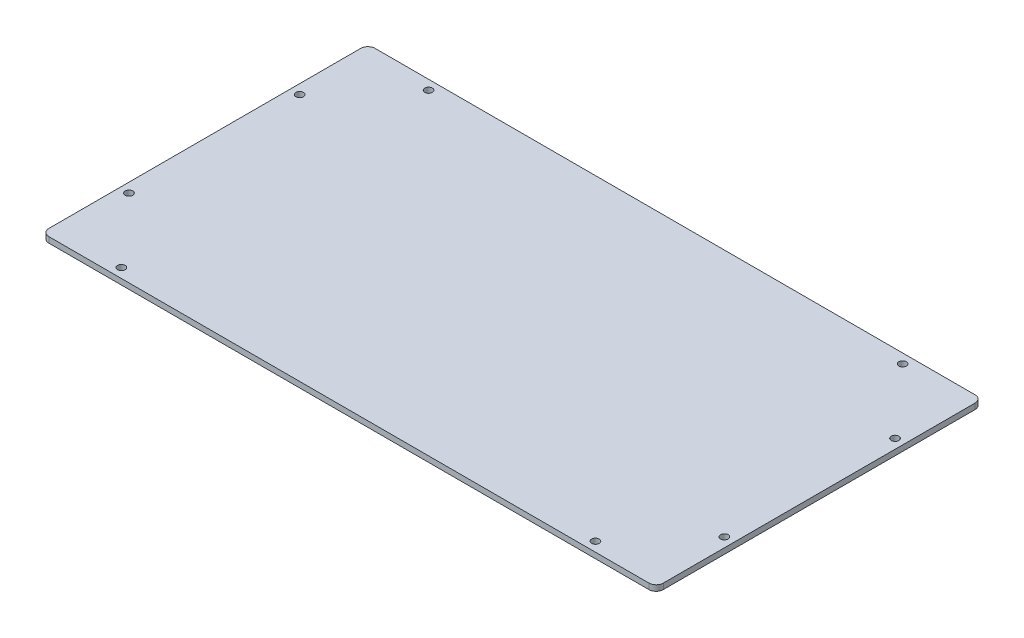
ISO-10303-21;
HEADER;
FILE_DESCRIPTION(('STEP AP214'),'2;1');
FILE_NAME('part.step','',(''),(''),'','','');
FILE_SCHEMA(('AUTOMOTIVE_DESIGN { 1 0 10303 214 1 1 1 1 }'));
ENDSEC;
DATA;
#1=APPLICATION_CONTEXT('core data for automotive mechanical design processes');
#2=APPLICATION_PROTOCOL_DEFINITION('international standard','automotive_design',2000,#1);
#3=PRODUCT_CONTEXT('',#1,'mechanical');
#4=PRODUCT('Part','Part','',(#3));
#5=PRODUCT_RELATED_PRODUCT_CATEGORY('part','',(#4));
#6=PRODUCT_DEFINITION_FORMATION('','',#4);
#7=PRODUCT_DEFINITION_CONTEXT('part definition',#1,'design');
#8=PRODUCT_DEFINITION('design','',#6,#7);
#9=PRODUCT_DEFINITION_SHAPE('','',#8);
#10=(LENGTH_UNIT() NAMED_UNIT(*) SI_UNIT(.MILLI.,.METRE.));
#11=(NAMED_UNIT(*) PLANE_ANGLE_UNIT() SI_UNIT($,.RADIAN.));
#12=(NAMED_UNIT(*) SI_UNIT($,.STERADIAN.) SOLID_ANGLE_UNIT());
#13=UNCERTAINTY_MEASURE_WITH_UNIT(LENGTH_MEASURE(1.E-05),#10,'distance_accuracy_value','');
#14=(GEOMETRIC_REPRESENTATION_CONTEXT(3) GLOBAL_UNCERTAINTY_ASSIGNED_CONTEXT((#13)) GLOBAL_UNIT_ASSIGNED_CONTEXT((#10,
#11,#12)) REPRESENTATION_CONTEXT('',''));
#15=CARTESIAN_POINT('',(0.,0.,0.));
#16=DIRECTION('',(0.,0.,1.));
#17=DIRECTION('',(1.,0.,0.));
#18=AXIS2_PLACEMENT_3D('',#15,#16,#17);
#19=CARTESIAN_POINT('',(158.2,0.,-82.2));
#20=DIRECTION('',(0.,-1.,0.));
#21=DIRECTION('',(0.,0.,-1.));
#22=AXIS2_PLACEMENT_3D('',#19,#20,#21);
#23=CYLINDRICAL_SURFACE('',#22,3.8);
#24=CARTESIAN_POINT('',(158.2,-3.,-82.2));
#25=DIRECTION('',(0.,-1.,0.));
#26=DIRECTION('',(0.,0.,-1.));
#27=AXIS2_PLACEMENT_3D('',#24,#25,#26);
#28=CIRCLE('',#27,3.8);
#29=CARTESIAN_POINT('',(158.2,-3.,-86.));
#30=VERTEX_POINT('',#29);
#31=CARTESIAN_POINT('',(162.,-3.,-82.2));
#32=VERTEX_POINT('',#31);
#33=EDGE_CURVE('E131',#30,#32,#28,.T.);
#34=ORIENTED_EDGE('',*,*,#33,.F.);
#35=DIRECTION('',(0.,-1.,0.));
#36=VECTOR('',#35,1.);
#37=CARTESIAN_POINT('',(158.2,0.,-86.));
#38=LINE('',#37,#36);
#39=CARTESIAN_POINT('',(158.2,0.,-86.));
#40=VERTEX_POINT('',#39);
#41=EDGE_CURVE('E11',#40,#30,#38,.T.);
#42=ORIENTED_EDGE('',*,*,#41,.F.);
#43=CARTESIAN_POINT('',(158.2,0.,-82.2));
#44=DIRECTION('',(0.,-1.,0.));
#45=DIRECTION('',(0.,0.,-1.));
#46=AXIS2_PLACEMENT_3D('',#43,#44,#45);
#47=CIRCLE('',#46,3.8);
#48=CARTESIAN_POINT('',(162.,0.,-82.2));
#49=VERTEX_POINT('',#48);
#50=EDGE_CURVE('E152',#40,#49,#47,.T.);
#51=ORIENTED_EDGE('',*,*,#50,.T.);
#52=DIRECTION('',(0.,-1.,0.));
#53=VECTOR('',#52,1.);
#54=CARTESIAN_POINT('',(162.,0.,-82.2));
#55=LINE('',#54,#53);
#56=EDGE_CURVE('E37',#49,#32,#55,.T.);
#57=ORIENTED_EDGE('',*,*,#56,.T.);
#58=EDGE_LOOP('',(#34,#42,#51,#57));
#59=FACE_BOUND('',#58,.T.);
#60=ADVANCED_FACE('F34',(#59),#23,.T.);
#61=CARTESIAN_POINT('',(-158.2,0.,-86.));
#62=DIRECTION('',(0.,0.,-1.));
#63=DIRECTION('',(-1.,0.,0.));
#64=AXIS2_PLACEMENT_3D('',#61,#62,#63);
#65=PLANE('',#64);
#66=DIRECTION('',(1.,0.,0.));
#67=VECTOR('',#66,1.);
#68=CARTESIAN_POINT('',(-158.2,-3.,-86.));
#69=LINE('',#68,#67);
#70=CARTESIAN_POINT('',(-158.2,-3.,-86.));
#71=VERTEX_POINT('',#70);
#72=EDGE_CURVE('E150',#71,#30,#69,.T.);
#73=ORIENTED_EDGE('',*,*,#72,.F.);
#74=DIRECTION('',(0.,-1.,0.));
#75=VECTOR('',#74,1.);
#76=CARTESIAN_POINT('',(-158.2,0.,-86.));
#77=LINE('',#76,#75);
#78=CARTESIAN_POINT('',(-158.2,0.,-86.));
#79=VERTEX_POINT('',#78);
#80=EDGE_CURVE('E43',#79,#71,#77,.T.);
#81=ORIENTED_EDGE('',*,*,#80,.F.);
#82=DIRECTION('',(1.,0.,0.));
#83=VECTOR('',#82,1.);
#84=CARTESIAN_POINT('',(-158.2,0.,-86.));
#85=LINE('',#84,#83);
#86=EDGE_CURVE('E121',#79,#40,#85,.T.);
#87=ORIENTED_EDGE('',*,*,#86,.T.);
#88=ORIENTED_EDGE('',*,*,#41,.T.);
#89=EDGE_LOOP('',(#73,#81,#87,#88));
#90=FACE_BOUND('',#89,.T.);
#91=ADVANCED_FACE('F164',(#90),#65,.T.);
#92=CARTESIAN_POINT('',(-158.2,0.,-82.2));
#93=DIRECTION('',(0.,-1.,0.));
#94=DIRECTION('',(0.,0.,-1.));
#95=AXIS2_PLACEMENT_3D('',#92,#93,#94);
#96=CYLINDRICAL_SURFACE('',#95,3.8);
#97=CARTESIAN_POINT('',(-158.2,-3.,-82.2));
#98=DIRECTION('',(0.,-1.,0.));
#99=DIRECTION('',(0.,0.,-1.));
#100=AXIS2_PLACEMENT_3D('',#97,#98,#99);
#101=CIRCLE('',#100,3.8);
#102=CARTESIAN_POINT('',(-162.,-3.,-82.2));
#103=VERTEX_POINT('',#102);
#104=EDGE_CURVE('E108',#103,#71,#101,.T.);
#105=ORIENTED_EDGE('',*,*,#104,.F.);
#106=DIRECTION('',(0.,-1.,0.));
#107=VECTOR('',#106,1.);
#108=CARTESIAN_POINT('',(-162.,0.,-82.2));
#109=LINE('',#108,#107);
#110=CARTESIAN_POINT('',(-162.,0.,-82.2));
#111=VERTEX_POINT('',#110);
#112=EDGE_CURVE('E103',#111,#103,#109,.T.);
#113=ORIENTED_EDGE('',*,*,#112,.F.);
#114=CARTESIAN_POINT('',(-158.2,0.,-82.2));
#115=DIRECTION('',(0.,-1.,0.));
#116=DIRECTION('',(0.,0.,-1.));
#117=AXIS2_PLACEMENT_3D('',#114,#115,#116);
#118=CIRCLE('',#117,3.8);
#119=EDGE_CURVE('E106',#111,#79,#118,.T.);
#120=ORIENTED_EDGE('',*,*,#119,.T.);
#121=ORIENTED_EDGE('',*,*,#80,.T.);
#122=EDGE_LOOP('',(#105,#113,#120,#121));
#123=FACE_BOUND('',#122,.T.);
#124=ADVANCED_FACE('F105',(#123),#96,.T.);
#125=CARTESIAN_POINT('',(-162.,0.,82.2));
#126=DIRECTION('',(-1.,0.,0.));
#127=DIRECTION('',(0.,0.,1.));
#128=AXIS2_PLACEMENT_3D('',#125,#126,#127);
#129=PLANE('',#128);
#130=DIRECTION('',(0.,0.,-1.));
#131=VECTOR('',#130,1.);
#132=CARTESIAN_POINT('',(-162.,-3.,82.2));
#133=LINE('',#132,#131);
#134=CARTESIAN_POINT('',(-162.,-3.,82.2));
#135=VERTEX_POINT('',#134);
#136=EDGE_CURVE('E147',#135,#103,#133,.T.);
#137=ORIENTED_EDGE('',*,*,#136,.F.);
#138=DIRECTION('',(0.,-1.,0.));
#139=VECTOR('',#138,1.);
#140=CARTESIAN_POINT('',(-162.,0.,82.2));
#141=LINE('',#140,#139);
#142=CARTESIAN_POINT('',(-162.,0.,82.2));
#143=VERTEX_POINT('',#142);
#144=EDGE_CURVE('E113',#143,#135,#141,.T.);
#145=ORIENTED_EDGE('',*,*,#144,.F.);
#146=DIRECTION('',(0.,0.,-1.));
#147=VECTOR('',#146,1.);
#148=CARTESIAN_POINT('',(-162.,0.,82.2));
#149=LINE('',#148,#147);
#150=EDGE_CURVE('E119',#143,#111,#149,.T.);
#151=ORIENTED_EDGE('',*,*,#150,.T.);
#152=ORIENTED_EDGE('',*,*,#112,.T.);
#153=EDGE_LOOP('',(#137,#145,#151,#152));
#154=FACE_BOUND('',#153,.T.);
#155=ADVANCED_FACE('F123',(#154),#129,.T.);
#156=CARTESIAN_POINT('',(-158.2,0.,82.2));
#157=DIRECTION('',(0.,-1.,0.));
#158=DIRECTION('',(0.,0.,-1.));
#159=AXIS2_PLACEMENT_3D('',#156,#157,#158);
#160=CYLINDRICAL_SURFACE('',#159,3.8);
#161=CARTESIAN_POINT('',(-158.2,-3.,82.2));
#162=DIRECTION('',(0.,-1.,0.));
#163=DIRECTION('',(0.,0.,-1.));
#164=AXIS2_PLACEMENT_3D('',#161,#162,#163);
#165=CIRCLE('',#164,3.8);
#166=CARTESIAN_POINT('',(-158.2,-3.,86.));
#167=VERTEX_POINT('',#166);
#168=EDGE_CURVE('E144',#167,#135,#165,.T.);
#169=ORIENTED_EDGE('',*,*,#168,.F.);
#170=DIRECTION('',(0.,-1.,0.));
#171=VECTOR('',#170,1.);
#172=CARTESIAN_POINT('',(-158.2,0.,86.));
#173=LINE('',#172,#171);
#174=CARTESIAN_POINT('',(-158.2,0.,86.));
#175=VERTEX_POINT('',#174);
#176=EDGE_CURVE('E156',#175,#167,#173,.T.);
#177=ORIENTED_EDGE('',*,*,#176,.F.);
#178=CARTESIAN_POINT('',(-158.2,0.,82.2));
#179=DIRECTION('',(0.,-1.,0.));
#180=DIRECTION('',(0.,0.,-1.));
#181=AXIS2_PLACEMENT_3D('',#178,#179,#180);
#182=CIRCLE('',#181,3.8);
#183=EDGE_CURVE('E124',#175,#143,#182,.T.);
#184=ORIENTED_EDGE('',*,*,#183,.T.);
#185=ORIENTED_EDGE('',*,*,#144,.T.);
#186=EDGE_LOOP('',(#169,#177,#184,#185));
#187=FACE_BOUND('',#186,.T.);
#188=ADVANCED_FACE('F177',(#187),#160,.T.);
#189=CARTESIAN_POINT('',(158.2,0.,86.));
#190=DIRECTION('',(0.,0.,1.));
#191=DIRECTION('',(1.,0.,0.));
#192=AXIS2_PLACEMENT_3D('',#189,#190,#191);
#193=PLANE('',#192);
#194=DIRECTION('',(-1.,0.,0.));
#195=VECTOR('',#194,1.);
#196=CARTESIAN_POINT('',(158.2,-3.,86.));
#197=LINE('',#196,#195);
#198=CARTESIAN_POINT('',(158.2,-3.,86.));
#199=VERTEX_POINT('',#198);
#200=EDGE_CURVE('E141',#199,#167,#197,.T.);
#201=ORIENTED_EDGE('',*,*,#200,.F.);
#202=DIRECTION('',(0.,-1.,0.));
#203=VECTOR('',#202,1.);
#204=CARTESIAN_POINT('',(158.2,0.,86.));
#205=LINE('',#204,#203);
#206=CARTESIAN_POINT('',(158.2,0.,86.));
#207=VERTEX_POINT('',#206);
#208=EDGE_CURVE('E158',#207,#199,#205,.T.);
#209=ORIENTED_EDGE('',*,*,#208,.F.);
#210=DIRECTION('',(-1.,0.,0.));
#211=VECTOR('',#210,1.);
#212=CARTESIAN_POINT('',(158.2,0.,86.));
#213=LINE('',#212,#211);
#214=EDGE_CURVE('E126',#207,#175,#213,.T.);
#215=ORIENTED_EDGE('',*,*,#214,.T.);
#216=ORIENTED_EDGE('',*,*,#176,.T.);
#217=EDGE_LOOP('',(#201,#209,#215,#216));
#218=FACE_BOUND('',#217,.T.);
#219=ADVANCED_FACE('F180',(#218),#193,.T.);
#220=CARTESIAN_POINT('',(158.2,0.,82.2));
#221=DIRECTION('',(0.,-1.,0.));
#222=DIRECTION('',(0.,0.,-1.));
#223=AXIS2_PLACEMENT_3D('',#220,#221,#222);
#224=CYLINDRICAL_SURFACE('',#223,3.8);
#225=CARTESIAN_POINT('',(158.2,-3.,82.2));
#226=DIRECTION('',(0.,-1.,0.));
#227=DIRECTION('',(0.,0.,-1.));
#228=AXIS2_PLACEMENT_3D('',#225,#226,#227);
#229=CIRCLE('',#228,3.8);
#230=CARTESIAN_POINT('',(162.,-3.,82.2));
#231=VERTEX_POINT('',#230);
#232=EDGE_CURVE('E138',#231,#199,#229,.T.);
#233=ORIENTED_EDGE('',*,*,#232,.F.);
#234=DIRECTION('',(0.,-1.,0.));
#235=VECTOR('',#234,1.);
#236=CARTESIAN_POINT('',(162.,0.,82.2));
#237=LINE('',#236,#235);
#238=CARTESIAN_POINT('',(162.,0.,82.2));
#239=VERTEX_POINT('',#238);
#240=EDGE_CURVE('E159',#239,#231,#237,.T.);
#241=ORIENTED_EDGE('',*,*,#240,.F.);
#242=CARTESIAN_POINT('',(158.2,0.,82.2));
#243=DIRECTION('',(0.,-1.,0.));
#244=DIRECTION('',(0.,0.,-1.));
#245=AXIS2_PLACEMENT_3D('',#242,#243,#244);
#246=CIRCLE('',#245,3.8);
#247=EDGE_CURVE('E286',#239,#207,#246,.T.);
#248=ORIENTED_EDGE('',*,*,#247,.T.);
#249=ORIENTED_EDGE('',*,*,#208,.T.);
#250=EDGE_LOOP('',(#233,#241,#248,#249));
#251=FACE_BOUND('',#250,.T.);
#252=ADVANCED_FACE('F184',(#251),#224,.T.);
#253=CARTESIAN_POINT('',(162.,0.,-82.2));
#254=DIRECTION('',(1.,0.,0.));
#255=DIRECTION('',(0.,0.,-1.));
#256=AXIS2_PLACEMENT_3D('',#253,#254,#255);
#257=PLANE('',#256);
#258=DIRECTION('',(0.,0.,1.));
#259=VECTOR('',#258,1.);
#260=CARTESIAN_POINT('',(162.,-3.,-82.2));
#261=LINE('',#260,#259);
#262=EDGE_CURVE('E134',#32,#231,#261,.T.);
#263=ORIENTED_EDGE('',*,*,#262,.F.);
#264=ORIENTED_EDGE('',*,*,#56,.F.);
#265=DIRECTION('',(0.,0.,1.));
#266=VECTOR('',#265,1.);
#267=CARTESIAN_POINT('',(162.,0.,-82.2));
#268=LINE('',#267,#266);
#269=EDGE_CURVE('E284',#49,#239,#268,.T.);
#270=ORIENTED_EDGE('',*,*,#269,.T.);
#271=ORIENTED_EDGE('',*,*,#240,.T.);
#272=EDGE_LOOP('',(#263,#264,#270,#271));
#273=FACE_BOUND('',#272,.T.);
#274=ADVANCED_FACE('F161',(#273),#257,.T.);
#275=CARTESIAN_POINT('',(158.2,0.,-82.2));
#276=DIRECTION('',(0.,-1.,0.));
#277=DIRECTION('',(0.,0.,-1.));
#278=AXIS2_PLACEMENT_3D('',#275,#276,#277);
#279=PLANE('',#278);
#280=CARTESIAN_POINT('',(-125.,0.,81.));
#281=DIRECTION('',(0.,-1.,0.));
#282=DIRECTION('',(0.,0.,1.));
#283=AXIS2_PLACEMENT_3D('',#280,#281,#282);
#284=CIRCLE('',#283,2.);
#285=CARTESIAN_POINT('',(-125.,0.,83.));
#286=VERTEX_POINT('',#285);
#287=EDGE_CURVE('E235',#286,#286,#284,.T.);
#288=ORIENTED_EDGE('',*,*,#287,.T.);
#289=EDGE_LOOP('',(#288));
#290=FACE_BOUND('',#289,.T.);
#291=CARTESIAN_POINT('',(125.,0.,81.));
#292=DIRECTION('',(0.,-1.,0.));
#293=DIRECTION('',(0.,0.,1.));
#294=AXIS2_PLACEMENT_3D('',#291,#292,#293);
#295=CIRCLE('',#294,2.);
#296=CARTESIAN_POINT('',(125.,0.,83.));
#297=VERTEX_POINT('',#296);
#298=EDGE_CURVE('E243',#297,#297,#295,.T.);
#299=ORIENTED_EDGE('',*,*,#298,.T.);
#300=EDGE_LOOP('',(#299));
#301=FACE_BOUND('',#300,.T.);
#302=CARTESIAN_POINT('',(-157.,0.,45.));
#303=DIRECTION('',(0.,-1.,0.));
#304=DIRECTION('',(0.,0.,1.));
#305=AXIS2_PLACEMENT_3D('',#302,#303,#304);
#306=CIRCLE('',#305,2.);
#307=CARTESIAN_POINT('',(-157.,0.,47.));
#308=VERTEX_POINT('',#307);
#309=EDGE_CURVE('E249',#308,#308,#306,.T.);
#310=ORIENTED_EDGE('',*,*,#309,.T.);
#311=EDGE_LOOP('',(#310));
#312=FACE_BOUND('',#311,.T.);
#313=CARTESIAN_POINT('',(-157.,0.,-45.));
#314=DIRECTION('',(0.,-1.,0.));
#315=DIRECTION('',(0.,0.,1.));
#316=AXIS2_PLACEMENT_3D('',#313,#314,#315);
#317=CIRCLE('',#316,2.);
#318=CARTESIAN_POINT('',(-157.,0.,-43.));
#319=VERTEX_POINT('',#318);
#320=EDGE_CURVE('E255',#319,#319,#317,.T.);
#321=ORIENTED_EDGE('',*,*,#320,.T.);
#322=EDGE_LOOP('',(#321));
#323=FACE_BOUND('',#322,.T.);
#324=CARTESIAN_POINT('',(-125.,0.,-81.));
#325=DIRECTION('',(0.,-1.,0.));
#326=DIRECTION('',(0.,0.,1.));
#327=AXIS2_PLACEMENT_3D('',#324,#325,#326);
#328=CIRCLE('',#327,2.);
#329=CARTESIAN_POINT('',(-125.,0.,-79.));
#330=VERTEX_POINT('',#329);
#331=EDGE_CURVE('E261',#330,#330,#328,.T.);
#332=ORIENTED_EDGE('',*,*,#331,.T.);
#333=EDGE_LOOP('',(#332));
#334=FACE_BOUND('',#333,.T.);
#335=CARTESIAN_POINT('',(125.,0.,-81.));
#336=DIRECTION('',(0.,-1.,0.));
#337=DIRECTION('',(0.,0.,1.));
#338=AXIS2_PLACEMENT_3D('',#335,#336,#337);
#339=CIRCLE('',#338,2.);
#340=CARTESIAN_POINT('',(125.,0.,-79.));
#341=VERTEX_POINT('',#340);
#342=EDGE_CURVE('E267',#341,#341,#339,.T.);
#343=ORIENTED_EDGE('',*,*,#342,.T.);
#344=EDGE_LOOP('',(#343));
#345=FACE_BOUND('',#344,.T.);
#346=CARTESIAN_POINT('',(157.,0.,-45.));
#347=DIRECTION('',(0.,-1.,0.));
#348=DIRECTION('',(0.,0.,1.));
#349=AXIS2_PLACEMENT_3D('',#346,#347,#348);
#350=CIRCLE('',#349,2.);
#351=CARTESIAN_POINT('',(157.,0.,-43.));
#352=VERTEX_POINT('',#351);
#353=EDGE_CURVE('E273',#352,#352,#350,.T.);
#354=ORIENTED_EDGE('',*,*,#353,.T.);
#355=EDGE_LOOP('',(#354));
#356=FACE_BOUND('',#355,.T.);
#357=CARTESIAN_POINT('',(157.,0.,45.));
#358=DIRECTION('',(0.,-1.,0.));
#359=DIRECTION('',(0.,0.,1.));
#360=AXIS2_PLACEMENT_3D('',#357,#358,#359);
#361=CIRCLE('',#360,2.);
#362=CARTESIAN_POINT('',(157.,0.,47.));
#363=VERTEX_POINT('',#362);
#364=EDGE_CURVE('E135',#363,#363,#361,.T.);
#365=ORIENTED_EDGE('',*,*,#364,.T.);
#366=EDGE_LOOP('',(#365));
#367=FACE_BOUND('',#366,.T.);
#368=ORIENTED_EDGE('',*,*,#50,.F.);
#369=ORIENTED_EDGE('',*,*,#86,.F.);
#370=ORIENTED_EDGE('',*,*,#119,.F.);
#371=ORIENTED_EDGE('',*,*,#150,.F.);
#372=ORIENTED_EDGE('',*,*,#183,.F.);
#373=ORIENTED_EDGE('',*,*,#214,.F.);
#374=ORIENTED_EDGE('',*,*,#247,.F.);
#375=ORIENTED_EDGE('',*,*,#269,.F.);
#376=EDGE_LOOP('',(#368,#369,#370,#371,#372,#373,#374,#375));
#377=FACE_BOUND('',#376,.T.);
#378=ADVANCED_FACE('F117',(#290,#301,#312,#323,#334,#345,#356,#367,#377),#279,.F.);
#379=CARTESIAN_POINT('',(158.2,-3.,-82.2));
#380=DIRECTION('',(0.,-1.,0.));
#381=DIRECTION('',(0.,0.,-1.));
#382=AXIS2_PLACEMENT_3D('',#379,#380,#381);
#383=PLANE('',#382);
#384=CARTESIAN_POINT('',(-125.,-3.,81.));
#385=DIRECTION('',(0.,-1.,0.));
#386=DIRECTION('',(0.,0.,1.));
#387=AXIS2_PLACEMENT_3D('',#384,#385,#386);
#388=CIRCLE('',#387,2.);
#389=CARTESIAN_POINT('',(-125.,-3.,83.));
#390=VERTEX_POINT('',#389);
#391=EDGE_CURVE('E238',#390,#390,#388,.T.);
#392=ORIENTED_EDGE('',*,*,#391,.F.);
#393=EDGE_LOOP('',(#392));
#394=FACE_BOUND('',#393,.T.);
#395=CARTESIAN_POINT('',(125.,-3.,81.));
#396=DIRECTION('',(0.,-1.,0.));
#397=DIRECTION('',(0.,0.,1.));
#398=AXIS2_PLACEMENT_3D('',#395,#396,#397);
#399=CIRCLE('',#398,2.);
#400=CARTESIAN_POINT('',(125.,-3.,83.));
#401=VERTEX_POINT('',#400);
#402=EDGE_CURVE('E240',#401,#401,#399,.T.);
#403=ORIENTED_EDGE('',*,*,#402,.F.);
#404=EDGE_LOOP('',(#403));
#405=FACE_BOUND('',#404,.T.);
#406=CARTESIAN_POINT('',(-157.,-3.,45.));
#407=DIRECTION('',(0.,-1.,0.));
#408=DIRECTION('',(0.,0.,1.));
#409=AXIS2_PLACEMENT_3D('',#406,#407,#408);
#410=CIRCLE('',#409,2.);
#411=CARTESIAN_POINT('',(-157.,-3.,47.));
#412=VERTEX_POINT('',#411);
#413=EDGE_CURVE('E246',#412,#412,#410,.T.);
#414=ORIENTED_EDGE('',*,*,#413,.F.);
#415=EDGE_LOOP('',(#414));
#416=FACE_BOUND('',#415,.T.);
#417=CARTESIAN_POINT('',(-157.,-3.,-45.));
#418=DIRECTION('',(0.,-1.,0.));
#419=DIRECTION('',(0.,0.,1.));
#420=AXIS2_PLACEMENT_3D('',#417,#418,#419);
#421=CIRCLE('',#420,2.);
#422=CARTESIAN_POINT('',(-157.,-3.,-43.));
#423=VERTEX_POINT('',#422);
#424=EDGE_CURVE('E252',#423,#423,#421,.T.);
#425=ORIENTED_EDGE('',*,*,#424,.F.);
#426=EDGE_LOOP('',(#425));
#427=FACE_BOUND('',#426,.T.);
#428=CARTESIAN_POINT('',(-125.,-3.,-81.));
#429=DIRECTION('',(0.,-1.,0.));
#430=DIRECTION('',(0.,0.,1.));
#431=AXIS2_PLACEMENT_3D('',#428,#429,#430);
#432=CIRCLE('',#431,2.);
#433=CARTESIAN_POINT('',(-125.,-3.,-79.));
#434=VERTEX_POINT('',#433);
#435=EDGE_CURVE('E258',#434,#434,#432,.T.);
#436=ORIENTED_EDGE('',*,*,#435,.F.);
#437=EDGE_LOOP('',(#436));
#438=FACE_BOUND('',#437,.T.);
#439=CARTESIAN_POINT('',(125.,-3.,-81.));
#440=DIRECTION('',(0.,-1.,0.));
#441=DIRECTION('',(0.,0.,1.));
#442=AXIS2_PLACEMENT_3D('',#439,#440,#441);
#443=CIRCLE('',#442,2.);
#444=CARTESIAN_POINT('',(125.,-3.,-79.));
#445=VERTEX_POINT('',#444);
#446=EDGE_CURVE('E264',#445,#445,#443,.T.);
#447=ORIENTED_EDGE('',*,*,#446,.F.);
#448=EDGE_LOOP('',(#447));
#449=FACE_BOUND('',#448,.T.);
#450=CARTESIAN_POINT('',(157.,-3.,-45.));
#451=DIRECTION('',(0.,-1.,0.));
#452=DIRECTION('',(0.,0.,1.));
#453=AXIS2_PLACEMENT_3D('',#450,#451,#452);
#454=CIRCLE('',#453,2.);
#455=CARTESIAN_POINT('',(157.,-3.,-43.));
#456=VERTEX_POINT('',#455);
#457=EDGE_CURVE('E270',#456,#456,#454,.T.);
#458=ORIENTED_EDGE('',*,*,#457,.F.);
#459=EDGE_LOOP('',(#458));
#460=FACE_BOUND('',#459,.T.);
#461=CARTESIAN_POINT('',(157.,-3.,45.));
#462=DIRECTION('',(0.,-1.,0.));
#463=DIRECTION('',(0.,0.,1.));
#464=AXIS2_PLACEMENT_3D('',#461,#462,#463);
#465=CIRCLE('',#464,2.);
#466=CARTESIAN_POINT('',(157.,-3.,47.));
#467=VERTEX_POINT('',#466);
#468=EDGE_CURVE('E276',#467,#467,#465,.T.);
#469=ORIENTED_EDGE('',*,*,#468,.F.);
#470=EDGE_LOOP('',(#469));
#471=FACE_BOUND('',#470,.T.);
#472=ORIENTED_EDGE('',*,*,#33,.T.);
#473=ORIENTED_EDGE('',*,*,#262,.T.);
#474=ORIENTED_EDGE('',*,*,#232,.T.);
#475=ORIENTED_EDGE('',*,*,#200,.T.);
#476=ORIENTED_EDGE('',*,*,#168,.T.);
#477=ORIENTED_EDGE('',*,*,#136,.T.);
#478=ORIENTED_EDGE('',*,*,#104,.T.);
#479=ORIENTED_EDGE('',*,*,#72,.T.);
#480=EDGE_LOOP('',(#472,#473,#474,#475,#476,#477,#478,#479));
#481=FACE_BOUND('',#480,.T.);
#482=ADVANCED_FACE('F163',(#394,#405,#416,#427,#438,#449,#460,#471,#481),#383,.T.);
#483=CARTESIAN_POINT('',(157.,0.,45.));
#484=DIRECTION('',(0.,-1.,0.));
#485=DIRECTION('',(0.,0.,-1.));
#486=AXIS2_PLACEMENT_3D('',#483,#484,#485);
#487=CYLINDRICAL_SURFACE('',#486,2.);
#488=ORIENTED_EDGE('',*,*,#364,.F.);
#489=EDGE_LOOP('',(#488));
#490=FACE_BOUND('',#489,.T.);
#491=ORIENTED_EDGE('',*,*,#468,.T.);
#492=EDGE_LOOP('',(#491));
#493=FACE_BOUND('',#492,.T.);
#494=ADVANCED_FACE('F196',(#490,#493),#487,.F.);
#495=CARTESIAN_POINT('',(157.,0.,-45.));
#496=DIRECTION('',(0.,-1.,0.));
#497=DIRECTION('',(0.,0.,-1.));
#498=AXIS2_PLACEMENT_3D('',#495,#496,#497);
#499=CYLINDRICAL_SURFACE('',#498,2.);
#500=ORIENTED_EDGE('',*,*,#353,.F.);
#501=EDGE_LOOP('',(#500));
#502=FACE_BOUND('',#501,.T.);
#503=ORIENTED_EDGE('',*,*,#457,.T.);
#504=EDGE_LOOP('',(#503));
#505=FACE_BOUND('',#504,.T.);
#506=ADVANCED_FACE('F203',(#502,#505),#499,.F.);
#507=CARTESIAN_POINT('',(125.,0.,-81.));
#508=DIRECTION('',(0.,-1.,0.));
#509=DIRECTION('',(0.,0.,-1.));
#510=AXIS2_PLACEMENT_3D('',#507,#508,#509);
#511=CYLINDRICAL_SURFACE('',#510,2.);
#512=ORIENTED_EDGE('',*,*,#342,.F.);
#513=EDGE_LOOP('',(#512));
#514=FACE_BOUND('',#513,.T.);
#515=ORIENTED_EDGE('',*,*,#446,.T.);
#516=EDGE_LOOP('',(#515));
#517=FACE_BOUND('',#516,.T.);
#518=ADVANCED_FACE('F207',(#514,#517),#511,.F.);
#519=CARTESIAN_POINT('',(-125.,0.,-81.));
#520=DIRECTION('',(0.,-1.,0.));
#521=DIRECTION('',(0.,0.,-1.));
#522=AXIS2_PLACEMENT_3D('',#519,#520,#521);
#523=CYLINDRICAL_SURFACE('',#522,2.);
#524=ORIENTED_EDGE('',*,*,#331,.F.);
#525=EDGE_LOOP('',(#524));
#526=FACE_BOUND('',#525,.T.);
#527=ORIENTED_EDGE('',*,*,#435,.T.);
#528=EDGE_LOOP('',(#527));
#529=FACE_BOUND('',#528,.T.);
#530=ADVANCED_FACE('F211',(#526,#529),#523,.F.);
#531=CARTESIAN_POINT('',(-157.,0.,-45.));
#532=DIRECTION('',(0.,-1.,0.));
#533=DIRECTION('',(0.,0.,-1.));
#534=AXIS2_PLACEMENT_3D('',#531,#532,#533);
#535=CYLINDRICAL_SURFACE('',#534,2.);
#536=ORIENTED_EDGE('',*,*,#320,.F.);
#537=EDGE_LOOP('',(#536));
#538=FACE_BOUND('',#537,.T.);
#539=ORIENTED_EDGE('',*,*,#424,.T.);
#540=EDGE_LOOP('',(#539));
#541=FACE_BOUND('',#540,.T.);
#542=ADVANCED_FACE('F215',(#538,#541),#535,.F.);
#543=CARTESIAN_POINT('',(-157.,0.,45.));
#544=DIRECTION('',(0.,-1.,0.));
#545=DIRECTION('',(0.,0.,-1.));
#546=AXIS2_PLACEMENT_3D('',#543,#544,#545);
#547=CYLINDRICAL_SURFACE('',#546,2.);
#548=ORIENTED_EDGE('',*,*,#309,.F.);
#549=EDGE_LOOP('',(#548));
#550=FACE_BOUND('',#549,.T.);
#551=ORIENTED_EDGE('',*,*,#413,.T.);
#552=EDGE_LOOP('',(#551));
#553=FACE_BOUND('',#552,.T.);
#554=ADVANCED_FACE('F219',(#550,#553),#547,.F.);
#555=CARTESIAN_POINT('',(125.,0.,81.));
#556=DIRECTION('',(0.,-1.,0.));
#557=DIRECTION('',(0.,0.,-1.));
#558=AXIS2_PLACEMENT_3D('',#555,#556,#557);
#559=CYLINDRICAL_SURFACE('',#558,2.);
#560=ORIENTED_EDGE('',*,*,#298,.F.);
#561=EDGE_LOOP('',(#560));
#562=FACE_BOUND('',#561,.T.);
#563=ORIENTED_EDGE('',*,*,#402,.T.);
#564=EDGE_LOOP('',(#563));
#565=FACE_BOUND('',#564,.T.);
#566=ADVANCED_FACE('F223',(#562,#565),#559,.F.);
#567=CARTESIAN_POINT('',(-125.,0.,81.));
#568=DIRECTION('',(0.,-1.,0.));
#569=DIRECTION('',(0.,0.,-1.));
#570=AXIS2_PLACEMENT_3D('',#567,#568,#569);
#571=CYLINDRICAL_SURFACE('',#570,2.);
#572=ORIENTED_EDGE('',*,*,#287,.F.);
#573=EDGE_LOOP('',(#572));
#574=FACE_BOUND('',#573,.T.);
#575=ORIENTED_EDGE('',*,*,#391,.T.);
#576=EDGE_LOOP('',(#575));
#577=FACE_BOUND('',#576,.T.);
#578=ADVANCED_FACE('F227',(#574,#577),#571,.F.);
#579=CLOSED_SHELL('',(#60,#91,#124,#155,#188,#219,#252,#274,#378,#482,#494,#506,#518,#530,#542,
#554,#566,#578));
#580=MANIFOLD_SOLID_BREP('B2',#579);
#581=ADVANCED_BREP_SHAPE_REPRESENTATION('',(#18,#580),#14);
#582=SHAPE_DEFINITION_REPRESENTATION(#9,#581);
ENDSEC;
END-ISO-10303-21;
